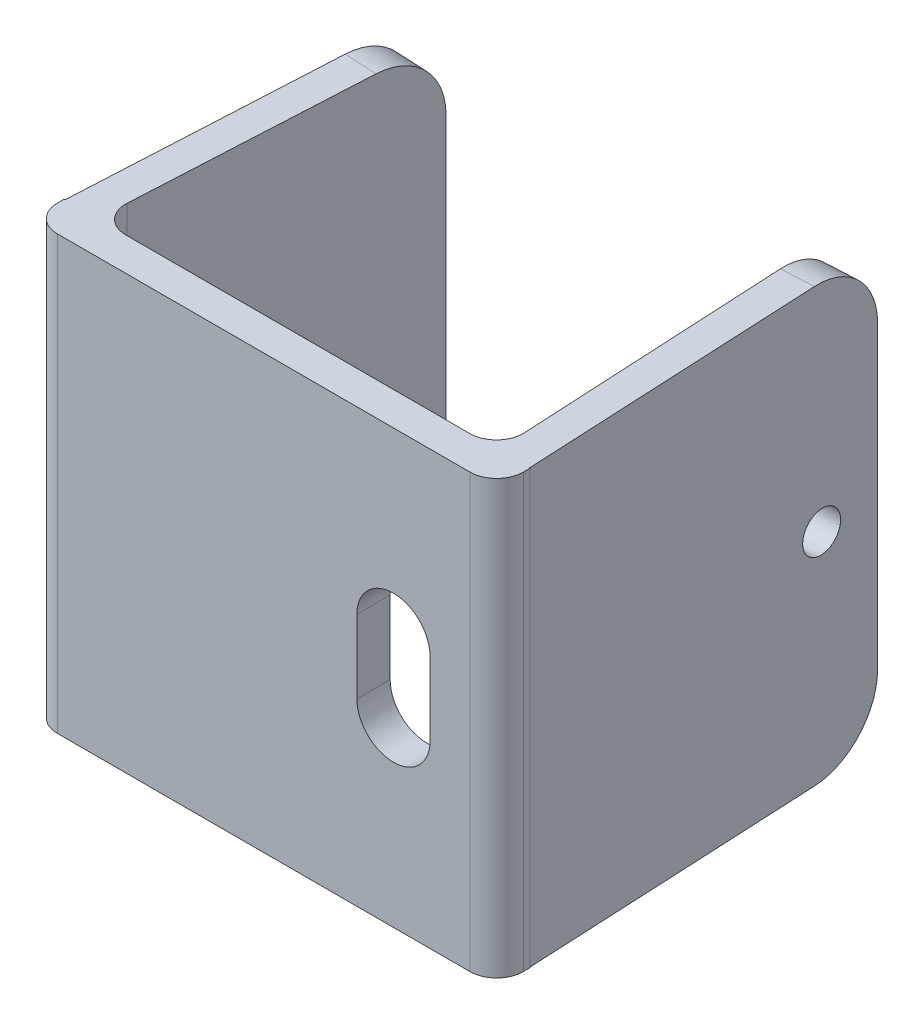
ISO-10303-21;
HEADER;
FILE_DESCRIPTION(('STEP AP214'),'2;1');
FILE_NAME('part.step','',(''),(''),'','','');
FILE_SCHEMA(('AUTOMOTIVE_DESIGN { 1 0 10303 214 1 1 1 1 }'));
ENDSEC;
DATA;
#1=APPLICATION_CONTEXT('core data for automotive mechanical design processes');
#2=APPLICATION_PROTOCOL_DEFINITION('international standard','automotive_design',2000,#1);
#3=PRODUCT_CONTEXT('',#1,'mechanical');
#4=PRODUCT('Part','Part','',(#3));
#5=PRODUCT_RELATED_PRODUCT_CATEGORY('part','',(#4));
#6=PRODUCT_DEFINITION_FORMATION('','',#4);
#7=PRODUCT_DEFINITION_CONTEXT('part definition',#1,'design');
#8=PRODUCT_DEFINITION('design','',#6,#7);
#9=PRODUCT_DEFINITION_SHAPE('','',#8);
#10=(LENGTH_UNIT() NAMED_UNIT(*) SI_UNIT(.MILLI.,.METRE.));
#11=(NAMED_UNIT(*) PLANE_ANGLE_UNIT() SI_UNIT($,.RADIAN.));
#12=(NAMED_UNIT(*) SI_UNIT($,.STERADIAN.) SOLID_ANGLE_UNIT());
#13=UNCERTAINTY_MEASURE_WITH_UNIT(LENGTH_MEASURE(1.E-05),#10,'distance_accuracy_value','');
#14=(GEOMETRIC_REPRESENTATION_CONTEXT(3) GLOBAL_UNCERTAINTY_ASSIGNED_CONTEXT((#13)) GLOBAL_UNIT_ASSIGNED_CONTEXT((#10,
#11,#12)) REPRESENTATION_CONTEXT('',''));
#15=CARTESIAN_POINT('',(0.,0.,0.));
#16=DIRECTION('',(0.,0.,1.));
#17=DIRECTION('',(1.,0.,0.));
#18=AXIS2_PLACEMENT_3D('',#15,#16,#17);
#19=CARTESIAN_POINT('',(0.,0.,0.));
#20=DIRECTION('',(0.,0.,1.));
#21=DIRECTION('',(1.,0.,0.));
#22=AXIS2_PLACEMENT_3D('',#19,#20,#21);
#23=PLANE('',#22);
#24=DIRECTION('',(1.,0.,0.));
#25=VECTOR('',#24,1.);
#26=CARTESIAN_POINT('',(17.5,-16.25,0.));
#27=LINE('',#26,#25);
#28=CARTESIAN_POINT('',(17.4598529224613,-16.25,0.));
#29=VERTEX_POINT('',#28);
#30=CARTESIAN_POINT('',(17.5,-16.25,0.));
#31=VERTEX_POINT('',#30);
#32=EDGE_CURVE('E271',#29,#31,#27,.T.);
#33=ORIENTED_EDGE('',*,*,#32,.F.);
#34=DIRECTION('',(0.,1.,0.));
#35=VECTOR('',#34,1.);
#36=CARTESIAN_POINT('',(17.4598529224613,0.,0.));
#37=LINE('',#36,#35);
#38=CARTESIAN_POINT('',(17.4598529224613,16.25,0.));
#39=VERTEX_POINT('',#38);
#40=EDGE_CURVE('E293',#29,#39,#37,.T.);
#41=ORIENTED_EDGE('',*,*,#40,.T.);
#42=DIRECTION('',(-1.,0.,0.));
#43=VECTOR('',#42,1.);
#44=CARTESIAN_POINT('',(17.5,16.25,0.));
#45=LINE('',#44,#43);
#46=CARTESIAN_POINT('',(17.5,16.25,0.));
#47=VERTEX_POINT('',#46);
#48=EDGE_CURVE('E265',#47,#39,#45,.T.);
#49=ORIENTED_EDGE('',*,*,#48,.F.);
#50=DIRECTION('',(0.,1.,0.));
#51=VECTOR('',#50,1.);
#52=CARTESIAN_POINT('',(17.5,-16.25,0.));
#53=LINE('',#52,#51);
#54=EDGE_CURVE('E275',#31,#47,#53,.T.);
#55=ORIENTED_EDGE('',*,*,#54,.F.);
#56=EDGE_LOOP('',(#33,#41,#49,#55));
#57=FACE_BOUND('',#56,.T.);
#58=ADVANCED_FACE('F35',(#57),#23,.F.);
#59=CARTESIAN_POINT('',(-17.4292836921049,16.25,0.));
#60=VERTEX_POINT('',#59);
#61=CARTESIAN_POINT('',(-17.5,16.25,0.));
#62=VERTEX_POINT('',#61);
#63=EDGE_CURVE('E279',#60,#62,#45,.T.);
#64=ORIENTED_EDGE('',*,*,#63,.F.);
#65=DIRECTION('',(0.,-1.,0.));
#66=VECTOR('',#65,1.);
#67=CARTESIAN_POINT('',(-17.4292836921049,0.,0.));
#68=LINE('',#67,#66);
#69=CARTESIAN_POINT('',(-17.4292836921049,-16.25,0.));
#70=VERTEX_POINT('',#69);
#71=EDGE_CURVE('E290',#60,#70,#68,.T.);
#72=ORIENTED_EDGE('',*,*,#71,.T.);
#73=CARTESIAN_POINT('',(-17.5,-16.25,0.));
#74=VERTEX_POINT('',#73);
#75=EDGE_CURVE('E272',#74,#70,#27,.T.);
#76=ORIENTED_EDGE('',*,*,#75,.F.);
#77=DIRECTION('',(0.,-1.,0.));
#78=VECTOR('',#77,1.);
#79=CARTESIAN_POINT('',(-17.5,-16.25,0.));
#80=LINE('',#79,#78);
#81=EDGE_CURVE('E260',#62,#74,#80,.T.);
#82=ORIENTED_EDGE('',*,*,#81,.F.);
#83=EDGE_LOOP('',(#64,#72,#76,#82));
#84=FACE_BOUND('',#83,.T.);
#85=ADVANCED_FACE('F394',(#84),#23,.F.);
#86=CARTESIAN_POINT('',(-17.5,-16.25,2.5));
#87=DIRECTION('',(1.,0.,0.));
#88=DIRECTION('',(0.,0.,-1.));
#89=AXIS2_PLACEMENT_3D('',#86,#87,#88);
#90=PLANE('',#89);
#91=DIRECTION('',(0.,0.,-1.));
#92=VECTOR('',#91,1.);
#93=CARTESIAN_POINT('',(-17.5,-16.25,2.5));
#94=LINE('',#93,#92);
#95=CARTESIAN_POINT('',(-17.5,-16.25,0.5));
#96=VERTEX_POINT('',#95);
#97=EDGE_CURVE('E288',#96,#74,#94,.T.);
#98=ORIENTED_EDGE('',*,*,#97,.F.);
#99=DIRECTION('',(0.,-1.,0.));
#100=VECTOR('',#99,1.);
#101=CARTESIAN_POINT('',(-17.5,16.25,0.5));
#102=LINE('',#101,#100);
#103=CARTESIAN_POINT('',(-17.5,16.25,0.5));
#104=VERTEX_POINT('',#103);
#105=EDGE_CURVE('E318',#96,#104,#102,.F.);
#106=ORIENTED_EDGE('',*,*,#105,.T.);
#107=DIRECTION('',(0.,0.,-1.));
#108=VECTOR('',#107,1.);
#109=CARTESIAN_POINT('',(-17.5,16.25,2.5));
#110=LINE('',#109,#108);
#111=EDGE_CURVE('E268',#104,#62,#110,.T.);
#112=ORIENTED_EDGE('',*,*,#111,.T.);
#113=ORIENTED_EDGE('',*,*,#81,.T.);
#114=EDGE_LOOP('',(#98,#106,#112,#113));
#115=FACE_BOUND('',#114,.T.);
#116=ADVANCED_FACE('F400',(#115),#90,.F.);
#117=CARTESIAN_POINT('',(17.5,-16.25,2.5));
#118=DIRECTION('',(0.,1.,0.));
#119=DIRECTION('',(0.,0.,1.));
#120=AXIS2_PLACEMENT_3D('',#117,#118,#119);
#121=PLANE('',#120);
#122=DIRECTION('',(-0.0516920789663743,0.,-0.998663070796219));
#123=VECTOR('',#122,1.);
#124=CARTESIAN_POINT('',(13.6759295593109,-16.25,-27.3719359468069));
#125=LINE('',#124,#123);
#126=CARTESIAN_POINT('',(14.9838621470204,-16.25,-2.10338415793275));
#127=VERTEX_POINT('',#126);
#128=CARTESIAN_POINT('',(13.9343900113653,-16.25,-22.3786194873182));
#129=VERTEX_POINT('',#128);
#130=EDGE_CURVE('E237',#127,#129,#125,.T.);
#131=ORIENTED_EDGE('',*,*,#130,.T.);
#132=DIRECTION('',(0.998628452320236,0.,-0.0523566062354244));
#133=VECTOR('',#132,1.);
#134=CARTESIAN_POINT('',(16.380353862213,-16.25,-22.5068577383988));
#135=LINE('',#134,#133);
#136=CARTESIAN_POINT('',(16.3621523674185,-16.25,-22.5059034610661));
#137=VERTEX_POINT('',#136);
#138=EDGE_CURVE('E337',#129,#137,#135,.T.);
#139=ORIENTED_EDGE('',*,*,#138,.T.);
#140=DIRECTION('',(0.0487159836036724,0.,0.998812671596394));
#141=VECTOR('',#140,1.);
#142=CARTESIAN_POINT('',(17.5,-16.25,0.823126350059698));
#143=LINE('',#142,#141);
#144=EDGE_CURVE('E235',#137,#29,#143,.T.);
#145=ORIENTED_EDGE('',*,*,#144,.T.);
#146=ORIENTED_EDGE('',*,*,#32,.T.);
#147=DIRECTION('',(0.,0.,-1.));
#148=VECTOR('',#147,1.);
#149=CARTESIAN_POINT('',(17.5,-16.25,2.5));
#150=LINE('',#149,#148);
#151=CARTESIAN_POINT('',(17.5,-16.25,0.5));
#152=VERTEX_POINT('',#151);
#153=EDGE_CURVE('E286',#152,#31,#150,.T.);
#154=ORIENTED_EDGE('',*,*,#153,.F.);
#155=CARTESIAN_POINT('',(15.5,-16.25,0.5));
#156=DIRECTION('',(0.,1.,0.));
#157=DIRECTION('',(0.,0.,1.));
#158=AXIS2_PLACEMENT_3D('',#155,#156,#157);
#159=CIRCLE('',#158,2.);
#160=CARTESIAN_POINT('',(15.5,-16.25,2.5));
#161=VERTEX_POINT('',#160);
#162=EDGE_CURVE('E314',#152,#161,#159,.F.);
#163=ORIENTED_EDGE('',*,*,#162,.T.);
#164=DIRECTION('',(1.,0.,0.));
#165=VECTOR('',#164,1.);
#166=CARTESIAN_POINT('',(17.5,-16.25,2.5));
#167=LINE('',#166,#165);
#168=CARTESIAN_POINT('',(-15.5,-16.25,2.5));
#169=VERTEX_POINT('',#168);
#170=EDGE_CURVE('E261',#169,#161,#167,.T.);
#171=ORIENTED_EDGE('',*,*,#170,.F.);
#172=CARTESIAN_POINT('',(-15.5,-16.25,0.5));
#173=DIRECTION('',(0.,1.,0.));
#174=DIRECTION('',(0.,0.,1.));
#175=AXIS2_PLACEMENT_3D('',#172,#173,#174);
#176=CIRCLE('',#175,2.);
#177=EDGE_CURVE('E316',#169,#96,#176,.F.);
#178=ORIENTED_EDGE('',*,*,#177,.T.);
#179=ORIENTED_EDGE('',*,*,#97,.T.);
#180=ORIENTED_EDGE('',*,*,#75,.T.);
#181=DIRECTION('',(0.0523566062354246,0.,-0.998628452320235));
#182=VECTOR('',#181,1.);
#183=CARTESIAN_POINT('',(-17.4321642402315,-16.25,0.0549423945573307));
#184=LINE('',#183,#182);
#185=CARTESIAN_POINT('',(-16.380353862213,-16.25,-20.0068577383988));
#186=VERTEX_POINT('',#185);
#187=EDGE_CURVE('E250',#70,#186,#184,.T.);
#188=ORIENTED_EDGE('',*,*,#187,.T.);
#189=DIRECTION('',(0.998628452320236,0.,0.0523566062354244));
#190=VECTOR('',#189,1.);
#191=CARTESIAN_POINT('',(-13.9377125904881,-16.25,-19.8787936852057));
#192=LINE('',#191,#190);
#193=CARTESIAN_POINT('',(-13.9377125904881,-16.25,-19.8787936852057));
#194=VERTEX_POINT('',#193);
#195=EDGE_CURVE('E334',#186,#194,#192,.T.);
#196=ORIENTED_EDGE('',*,*,#195,.T.);
#197=DIRECTION('',(-0.0523566062354247,0.,0.998628452320235));
#198=VECTOR('',#197,1.);
#199=CARTESIAN_POINT('',(-13.6759295593109,-16.25,-24.8719359468069));
#200=LINE('',#199,#198);
#201=CARTESIAN_POINT('',(-14.8695812252597,-16.25,-2.10471321247085));
#202=VERTEX_POINT('',#201);
#203=EDGE_CURVE('E234',#194,#202,#200,.T.);
#204=ORIENTED_EDGE('',*,*,#203,.T.);
#205=CARTESIAN_POINT('',(-12.8723243206192,-16.25,-2.));
#206=DIRECTION('',(0.,1.,0.));
#207=DIRECTION('',(0.,0.,1.));
#208=AXIS2_PLACEMENT_3D('',#205,#206,#207);
#209=CIRCLE('',#208,2.);
#210=CARTESIAN_POINT('',(-12.8723243206192,-16.25,0.));
#211=VERTEX_POINT('',#210);
#212=EDGE_CURVE('E332',#202,#211,#209,.T.);
#213=ORIENTED_EDGE('',*,*,#212,.T.);
#214=CARTESIAN_POINT('',(12.986536005428,-16.25,0.));
#215=VERTEX_POINT('',#214);
#216=EDGE_CURVE('E276',#211,#215,#27,.T.);
#217=ORIENTED_EDGE('',*,*,#216,.T.);
#218=CARTESIAN_POINT('',(12.986536005428,-16.25,-2.));
#219=DIRECTION('',(0.,1.,0.));
#220=DIRECTION('',(0.,0.,1.));
#221=AXIS2_PLACEMENT_3D('',#218,#219,#220);
#222=CIRCLE('',#221,2.);
#223=EDGE_CURVE('E326',#215,#127,#222,.T.);
#224=ORIENTED_EDGE('',*,*,#223,.T.);
#225=EDGE_LOOP('',(#131,#139,#145,#146,#154,#163,#171,#178,#179,#180,#188,#196,#204,#213,#217,#224));
#226=FACE_BOUND('',#225,.T.);
#227=ADVANCED_FACE('F460',(#226),#121,.F.);
#228=CARTESIAN_POINT('',(17.5,-16.25,2.5));
#229=DIRECTION('',(-1.,0.,0.));
#230=DIRECTION('',(0.,0.,1.));
#231=AXIS2_PLACEMENT_3D('',#228,#229,#230);
#232=PLANE('',#231);
#233=DIRECTION('',(0.,0.,-1.));
#234=VECTOR('',#233,1.);
#235=CARTESIAN_POINT('',(17.5,16.25,2.5));
#236=LINE('',#235,#234);
#237=CARTESIAN_POINT('',(17.5,16.25,0.5));
#238=VERTEX_POINT('',#237);
#239=EDGE_CURVE('E284',#238,#47,#236,.T.);
#240=ORIENTED_EDGE('',*,*,#239,.F.);
#241=DIRECTION('',(0.,1.,0.));
#242=VECTOR('',#241,1.);
#243=CARTESIAN_POINT('',(17.5,-16.25,0.5));
#244=LINE('',#243,#242);
#245=EDGE_CURVE('E324',#238,#152,#244,.F.);
#246=ORIENTED_EDGE('',*,*,#245,.T.);
#247=ORIENTED_EDGE('',*,*,#153,.T.);
#248=ORIENTED_EDGE('',*,*,#54,.T.);
#249=EDGE_LOOP('',(#240,#246,#247,#248));
#250=FACE_BOUND('',#249,.T.);
#251=ADVANCED_FACE('F418',(#250),#232,.F.);
#252=CARTESIAN_POINT('',(17.5,16.25,2.5));
#253=DIRECTION('',(0.,-1.,0.));
#254=DIRECTION('',(1.,0.,0.));
#255=AXIS2_PLACEMENT_3D('',#252,#253,#254);
#256=PLANE('',#255);
#257=DIRECTION('',(-0.0487159836036724,0.,-0.998812671596395));
#258=VECTOR('',#257,1.);
#259=CARTESIAN_POINT('',(17.5,16.25,0.823126350059698));
#260=LINE('',#259,#258);
#261=CARTESIAN_POINT('',(16.3621523674185,16.25,-22.5059034610661));
#262=VERTEX_POINT('',#261);
#263=EDGE_CURVE('E230',#39,#262,#260,.T.);
#264=ORIENTED_EDGE('',*,*,#263,.T.);
#265=DIRECTION('',(-0.998628452320236,0.,0.0523566062354244));
#266=VECTOR('',#265,1.);
#267=CARTESIAN_POINT('',(13.9377125904881,16.25,-22.3787936852057));
#268=LINE('',#267,#266);
#269=CARTESIAN_POINT('',(13.9343900113653,16.25,-22.3786194873182));
#270=VERTEX_POINT('',#269);
#271=EDGE_CURVE('E355',#262,#270,#268,.T.);
#272=ORIENTED_EDGE('',*,*,#271,.T.);
#273=DIRECTION('',(0.0516920789663743,0.,0.998663070796219));
#274=VECTOR('',#273,1.);
#275=CARTESIAN_POINT('',(13.6759295593109,16.25,-27.3719359468069));
#276=LINE('',#275,#274);
#277=CARTESIAN_POINT('',(14.9838621470204,16.25,-2.10338415793275));
#278=VERTEX_POINT('',#277);
#279=EDGE_CURVE('E228',#270,#278,#276,.T.);
#280=ORIENTED_EDGE('',*,*,#279,.T.);
#281=CARTESIAN_POINT('',(12.986536005428,16.25,-2.));
#282=DIRECTION('',(0.,-1.,0.));
#283=DIRECTION('',(1.,0.,0.));
#284=AXIS2_PLACEMENT_3D('',#281,#282,#283);
#285=CIRCLE('',#284,2.);
#286=CARTESIAN_POINT('',(12.986536005428,16.25,0.));
#287=VERTEX_POINT('',#286);
#288=EDGE_CURVE('E328',#278,#287,#285,.T.);
#289=ORIENTED_EDGE('',*,*,#288,.T.);
#290=CARTESIAN_POINT('',(-12.8723243206192,16.25,0.));
#291=VERTEX_POINT('',#290);
#292=EDGE_CURVE('E282',#287,#291,#45,.T.);
#293=ORIENTED_EDGE('',*,*,#292,.T.);
#294=CARTESIAN_POINT('',(-12.8723243206192,16.25,-2.));
#295=DIRECTION('',(0.,-1.,0.));
#296=DIRECTION('',(1.,0.,0.));
#297=AXIS2_PLACEMENT_3D('',#294,#295,#296);
#298=CIRCLE('',#297,2.);
#299=CARTESIAN_POINT('',(-14.8695812252597,16.25,-2.10471321247085));
#300=VERTEX_POINT('',#299);
#301=EDGE_CURVE('E330',#291,#300,#298,.T.);
#302=ORIENTED_EDGE('',*,*,#301,.T.);
#303=DIRECTION('',(0.0523566062354247,0.,-0.998628452320235));
#304=VECTOR('',#303,1.);
#305=CARTESIAN_POINT('',(-13.6759295593109,16.25,-24.8719359468069));
#306=LINE('',#305,#304);
#307=CARTESIAN_POINT('',(-13.9377125904881,16.25,-19.8787936852057));
#308=VERTEX_POINT('',#307);
#309=EDGE_CURVE('E247',#300,#308,#306,.T.);
#310=ORIENTED_EDGE('',*,*,#309,.T.);
#311=DIRECTION('',(-0.998628452320236,0.,-0.0523566062354244));
#312=VECTOR('',#311,1.);
#313=CARTESIAN_POINT('',(-16.380353862213,16.25,-20.0068577383988));
#314=LINE('',#313,#312);
#315=CARTESIAN_POINT('',(-16.380353862213,16.25,-20.0068577383988));
#316=VERTEX_POINT('',#315);
#317=EDGE_CURVE('E352',#308,#316,#314,.T.);
#318=ORIENTED_EDGE('',*,*,#317,.T.);
#319=DIRECTION('',(-0.0523566062354246,0.,0.998628452320236));
#320=VECTOR('',#319,1.);
#321=CARTESIAN_POINT('',(-17.4321642402315,16.25,0.0549423945573305));
#322=LINE('',#321,#320);
#323=EDGE_CURVE('E245',#316,#60,#322,.T.);
#324=ORIENTED_EDGE('',*,*,#323,.T.);
#325=ORIENTED_EDGE('',*,*,#63,.T.);
#326=ORIENTED_EDGE('',*,*,#111,.F.);
#327=CARTESIAN_POINT('',(-15.5,16.25,0.5));
#328=DIRECTION('',(0.,-1.,0.));
#329=DIRECTION('',(1.,0.,0.));
#330=AXIS2_PLACEMENT_3D('',#327,#328,#329);
#331=CIRCLE('',#330,2.);
#332=CARTESIAN_POINT('',(-15.5,16.25,2.5));
#333=VERTEX_POINT('',#332);
#334=EDGE_CURVE('E322',#104,#333,#331,.F.);
#335=ORIENTED_EDGE('',*,*,#334,.T.);
#336=DIRECTION('',(-1.,0.,0.));
#337=VECTOR('',#336,1.);
#338=CARTESIAN_POINT('',(17.5,16.25,2.5));
#339=LINE('',#338,#337);
#340=CARTESIAN_POINT('',(15.5,16.25,2.5));
#341=VERTEX_POINT('',#340);
#342=EDGE_CURVE('E264',#341,#333,#339,.T.);
#343=ORIENTED_EDGE('',*,*,#342,.F.);
#344=CARTESIAN_POINT('',(15.5,16.25,0.5));
#345=DIRECTION('',(0.,-1.,0.));
#346=DIRECTION('',(1.,0.,0.));
#347=AXIS2_PLACEMENT_3D('',#344,#345,#346);
#348=CIRCLE('',#347,2.);
#349=EDGE_CURVE('E320',#341,#238,#348,.F.);
#350=ORIENTED_EDGE('',*,*,#349,.T.);
#351=ORIENTED_EDGE('',*,*,#239,.T.);
#352=ORIENTED_EDGE('',*,*,#48,.T.);
#353=EDGE_LOOP('',(#264,#272,#280,#289,#293,#302,#310,#318,#324,#325,#326,#335,#343,#350,#351,#352));
#354=FACE_BOUND('',#353,.T.);
#355=ADVANCED_FACE('F414',(#354),#256,.F.);
#356=CARTESIAN_POINT('',(0.,0.,2.5));
#357=DIRECTION('',(0.,0.,1.));
#358=DIRECTION('',(1.,0.,0.));
#359=AXIS2_PLACEMENT_3D('',#356,#357,#358);
#360=PLANE('',#359);
#361=CARTESIAN_POINT('',(9.75000000000001,2.75,2.5));
#362=DIRECTION('',(0.,0.,1.));
#363=DIRECTION('',(1.,0.,0.));
#364=AXIS2_PLACEMENT_3D('',#361,#362,#363);
#365=CIRCLE('',#364,2.75);
#366=CARTESIAN_POINT('',(12.5,2.75,2.5));
#367=VERTEX_POINT('',#366);
#368=CARTESIAN_POINT('',(7.00000000000001,2.75,2.5));
#369=VERTEX_POINT('',#368);
#370=EDGE_CURVE('E50',#367,#369,#365,.T.);
#371=ORIENTED_EDGE('',*,*,#370,.F.);
#372=DIRECTION('',(0.,1.,0.));
#373=VECTOR('',#372,1.);
#374=CARTESIAN_POINT('',(12.5,2.75,2.5));
#375=LINE('',#374,#373);
#376=CARTESIAN_POINT('',(12.5,-2.75,2.5));
#377=VERTEX_POINT('',#376);
#378=EDGE_CURVE('E215',#377,#367,#375,.T.);
#379=ORIENTED_EDGE('',*,*,#378,.F.);
#380=CARTESIAN_POINT('',(9.75000000000001,-2.75,2.5));
#381=DIRECTION('',(0.,0.,1.));
#382=DIRECTION('',(1.,0.,0.));
#383=AXIS2_PLACEMENT_3D('',#380,#381,#382);
#384=CIRCLE('',#383,2.75);
#385=CARTESIAN_POINT('',(7.00000000000001,-2.75,2.5));
#386=VERTEX_POINT('',#385);
#387=EDGE_CURVE('E199',#386,#377,#384,.T.);
#388=ORIENTED_EDGE('',*,*,#387,.F.);
#389=DIRECTION('',(0.,-1.,0.));
#390=VECTOR('',#389,1.);
#391=CARTESIAN_POINT('',(7.00000000000001,2.75,2.5));
#392=LINE('',#391,#390);
#393=EDGE_CURVE('E208',#369,#386,#392,.T.);
#394=ORIENTED_EDGE('',*,*,#393,.F.);
#395=EDGE_LOOP('',(#371,#379,#388,#394));
#396=FACE_BOUND('',#395,.T.);
#397=ORIENTED_EDGE('',*,*,#342,.T.);
#398=DIRECTION('',(0.,-1.,0.));
#399=VECTOR('',#398,1.);
#400=CARTESIAN_POINT('',(-15.5,-16.25,2.5));
#401=LINE('',#400,#399);
#402=EDGE_CURVE('E311',#333,#169,#401,.T.);
#403=ORIENTED_EDGE('',*,*,#402,.T.);
#404=ORIENTED_EDGE('',*,*,#170,.T.);
#405=DIRECTION('',(0.,1.,0.));
#406=VECTOR('',#405,1.);
#407=CARTESIAN_POINT('',(15.5,16.25,2.5));
#408=LINE('',#407,#406);
#409=EDGE_CURVE('E308',#161,#341,#408,.T.);
#410=ORIENTED_EDGE('',*,*,#409,.T.);
#411=EDGE_LOOP('',(#397,#403,#404,#410));
#412=FACE_BOUND('',#411,.T.);
#413=ADVANCED_FACE('F212',(#396,#412),#360,.T.);
#414=DIRECTION('',(0.,1.,0.));
#415=VECTOR('',#414,1.);
#416=CARTESIAN_POINT('',(12.5,0.,0.));
#417=LINE('',#416,#415);
#418=CARTESIAN_POINT('',(12.5,-2.75,0.));
#419=VERTEX_POINT('',#418);
#420=CARTESIAN_POINT('',(12.5,2.75,0.));
#421=VERTEX_POINT('',#420);
#422=EDGE_CURVE('E43',#419,#421,#417,.T.);
#423=ORIENTED_EDGE('',*,*,#422,.T.);
#424=CARTESIAN_POINT('',(9.75000000000001,2.75,0.));
#425=DIRECTION('',(0.,0.,1.));
#426=DIRECTION('',(1.,0.,0.));
#427=AXIS2_PLACEMENT_3D('',#424,#425,#426);
#428=CIRCLE('',#427,2.75);
#429=CARTESIAN_POINT('',(7.00000000000001,2.75,0.));
#430=VERTEX_POINT('',#429);
#431=EDGE_CURVE('E11',#421,#430,#428,.T.);
#432=ORIENTED_EDGE('',*,*,#431,.T.);
#433=DIRECTION('',(0.,-1.,0.));
#434=VECTOR('',#433,1.);
#435=CARTESIAN_POINT('',(7.00000000000001,0.,0.));
#436=LINE('',#435,#434);
#437=CARTESIAN_POINT('',(7.00000000000001,-2.75,0.));
#438=VERTEX_POINT('',#437);
#439=EDGE_CURVE('E370',#430,#438,#436,.T.);
#440=ORIENTED_EDGE('',*,*,#439,.T.);
#441=CARTESIAN_POINT('',(9.75000000000001,-2.75,0.));
#442=DIRECTION('',(0.,0.,1.));
#443=DIRECTION('',(1.,0.,0.));
#444=AXIS2_PLACEMENT_3D('',#441,#442,#443);
#445=CIRCLE('',#444,2.75);
#446=EDGE_CURVE('E202',#438,#419,#445,.T.);
#447=ORIENTED_EDGE('',*,*,#446,.T.);
#448=EDGE_LOOP('',(#423,#432,#440,#447));
#449=FACE_BOUND('',#448,.T.);
#450=ORIENTED_EDGE('',*,*,#292,.F.);
#451=DIRECTION('',(0.,-1.,0.));
#452=VECTOR('',#451,1.);
#453=CARTESIAN_POINT('',(12.986536005428,0.,0.));
#454=LINE('',#453,#452);
#455=EDGE_CURVE('E299',#287,#215,#454,.T.);
#456=ORIENTED_EDGE('',*,*,#455,.T.);
#457=ORIENTED_EDGE('',*,*,#216,.F.);
#458=DIRECTION('',(0.,1.,0.));
#459=VECTOR('',#458,1.);
#460=CARTESIAN_POINT('',(-12.8723243206192,0.,0.));
#461=LINE('',#460,#459);
#462=EDGE_CURVE('E296',#211,#291,#461,.T.);
#463=ORIENTED_EDGE('',*,*,#462,.T.);
#464=EDGE_LOOP('',(#450,#456,#457,#463));
#465=FACE_BOUND('',#464,.T.);
#466=ADVANCED_FACE('F376',(#449,#465),#23,.F.);
#467=CARTESIAN_POINT('',(-17.4321642402315,44.8301154822159,0.0549423945573307));
#468=DIRECTION('',(-0.998628452320235,0.,-0.0523566062354246));
#469=DIRECTION('',(-0.0523566062354246,0.,0.998628452320236));
#470=AXIS2_PLACEMENT_3D('',#467,#468,#469);
#471=PLANE('',#470);
#472=DIRECTION('',(0.,-1.,0.));
#473=VECTOR('',#472,1.);
#474=CARTESIAN_POINT('',(-16.1185708310359,44.8301154822159,-25.));
#475=LINE('',#474,#473);
#476=CARTESIAN_POINT('',(-16.1185708310359,11.25,-25.));
#477=VERTEX_POINT('',#476);
#478=CARTESIAN_POINT('',(-16.1185708310359,-11.25,-25.));
#479=VERTEX_POINT('',#478);
#480=EDGE_CURVE('E248',#477,#479,#475,.T.);
#481=ORIENTED_EDGE('',*,*,#480,.T.);
#482=CARTESIAN_POINT('',(-16.380353862213,-11.25,-20.0068577383988));
#483=DIRECTION('',(-0.998628452320235,0.,-0.0523566062354246));
#484=DIRECTION('',(-0.0523566062354246,0.,0.998628452320236));
#485=AXIS2_PLACEMENT_3D('',#482,#483,#484);
#486=CIRCLE('',#485,5.);
#487=EDGE_CURVE('E368',#479,#186,#486,.T.);
#488=ORIENTED_EDGE('',*,*,#487,.T.);
#489=ORIENTED_EDGE('',*,*,#187,.F.);
#490=ORIENTED_EDGE('',*,*,#71,.F.);
#491=ORIENTED_EDGE('',*,*,#323,.F.);
#492=CARTESIAN_POINT('',(-16.380353862213,11.25,-20.0068577383988));
#493=DIRECTION('',(-0.998628452320235,0.,-0.0523566062354246));
#494=DIRECTION('',(-0.0523566062354246,0.,0.998628452320236));
#495=AXIS2_PLACEMENT_3D('',#492,#493,#494);
#496=CIRCLE('',#495,5.);
#497=EDGE_CURVE('E366',#316,#477,#496,.T.);
#498=ORIENTED_EDGE('',*,*,#497,.T.);
#499=EDGE_LOOP('',(#481,#488,#489,#490,#491,#498));
#500=FACE_BOUND('',#499,.T.);
#501=ADVANCED_FACE('F406',(#500),#471,.T.);
#502=CARTESIAN_POINT('',(-13.6759295593109,44.8301154822159,-24.8719359468069));
#503=DIRECTION('',(0.998628452320235,0.,0.0523566062354247));
#504=DIRECTION('',(0.0523566062354247,0.,-0.998628452320235));
#505=AXIS2_PLACEMENT_3D('',#502,#503,#504);
#506=PLANE('',#505);
#507=ORIENTED_EDGE('',*,*,#203,.F.);
#508=CARTESIAN_POINT('',(-13.9377125904881,-11.25,-19.8787936852057));
#509=DIRECTION('',(0.998628452320235,0.,0.0523566062354247));
#510=DIRECTION('',(0.0523566062354247,0.,-0.998628452320235));
#511=AXIS2_PLACEMENT_3D('',#508,#509,#510);
#512=CIRCLE('',#511,5.);
#513=CARTESIAN_POINT('',(-13.6759295593109,-11.25,-24.8719359468069));
#514=VERTEX_POINT('',#513);
#515=EDGE_CURVE('E360',#194,#514,#512,.T.);
#516=ORIENTED_EDGE('',*,*,#515,.T.);
#517=DIRECTION('',(0.,-1.,0.));
#518=VECTOR('',#517,1.);
#519=CARTESIAN_POINT('',(-13.6759295593109,44.8301154822159,-24.8719359468069));
#520=LINE('',#519,#518);
#521=CARTESIAN_POINT('',(-13.6759295593109,11.25,-24.8719359468069));
#522=VERTEX_POINT('',#521);
#523=EDGE_CURVE('E253',#522,#514,#520,.T.);
#524=ORIENTED_EDGE('',*,*,#523,.F.);
#525=CARTESIAN_POINT('',(-13.9377125904881,11.25,-19.8787936852057));
#526=DIRECTION('',(0.998628452320235,0.,0.0523566062354247));
#527=DIRECTION('',(0.0523566062354247,0.,-0.998628452320235));
#528=AXIS2_PLACEMENT_3D('',#525,#526,#527);
#529=CIRCLE('',#528,5.);
#530=EDGE_CURVE('E358',#522,#308,#529,.T.);
#531=ORIENTED_EDGE('',*,*,#530,.T.);
#532=ORIENTED_EDGE('',*,*,#309,.F.);
#533=DIRECTION('',(0.,1.,0.));
#534=VECTOR('',#533,1.);
#535=CARTESIAN_POINT('',(-14.8695812252597,44.8301154822159,-2.10471321247085));
#536=LINE('',#535,#534);
#537=EDGE_CURVE('E305',#300,#202,#536,.F.);
#538=ORIENTED_EDGE('',*,*,#537,.T.);
#539=EDGE_LOOP('',(#507,#516,#524,#531,#532,#538));
#540=FACE_BOUND('',#539,.T.);
#541=ADVANCED_FACE('F411',(#540),#506,.T.);
#542=CARTESIAN_POINT('',(-16.1185708310359,44.8301154822159,-25.));
#543=DIRECTION('',(0.0523566062354244,0.,-0.998628452320235));
#544=DIRECTION('',(-0.998628452320236,0.,-0.0523566062354244));
#545=AXIS2_PLACEMENT_3D('',#542,#543,#544);
#546=PLANE('',#545);
#547=ORIENTED_EDGE('',*,*,#523,.T.);
#548=DIRECTION('',(0.998628452320236,0.,0.0523566062354244));
#549=VECTOR('',#548,1.);
#550=CARTESIAN_POINT('',(-16.1185708310359,-11.25,-25.));
#551=LINE('',#550,#549);
#552=EDGE_CURVE('E364',#514,#479,#551,.F.);
#553=ORIENTED_EDGE('',*,*,#552,.T.);
#554=ORIENTED_EDGE('',*,*,#480,.F.);
#555=DIRECTION('',(-0.998628452320236,0.,-0.0523566062354244));
#556=VECTOR('',#555,1.);
#557=CARTESIAN_POINT('',(-13.675929559311,11.25,-24.8719359468069));
#558=LINE('',#557,#556);
#559=EDGE_CURVE('E362',#477,#522,#558,.F.);
#560=ORIENTED_EDGE('',*,*,#559,.T.);
#561=EDGE_LOOP('',(#547,#553,#554,#560));
#562=FACE_BOUND('',#561,.T.);
#563=ADVANCED_FACE('F421',(#562),#546,.T.);
#564=CARTESIAN_POINT('',(17.5,44.8301154822159,0.823126350059698));
#565=DIRECTION('',(0.998812671596394,0.,-0.0487159836036724));
#566=DIRECTION('',(-0.0487159836036724,0.,-0.998812671596395));
#567=AXIS2_PLACEMENT_3D('',#564,#565,#566);
#568=PLANE('',#567);
#569=CARTESIAN_POINT('',(16.3341625148755,0.,-23.079773007117));
#570=DIRECTION('',(0.998812671596395,0.,-0.0487159836036724));
#571=DIRECTION('',(-0.0487159836036724,0.,-0.998812671596395));
#572=AXIS2_PLACEMENT_3D('',#569,#570,#571);
#573=CIRCLE('',#572,1.5);
#574=CARTESIAN_POINT('',(16.26108853947,0.,-24.5779920145116));
#575=VERTEX_POINT('',#574);
#576=EDGE_CURVE('E222',#575,#575,#573,.T.);
#577=ORIENTED_EDGE('',*,*,#576,.F.);
#578=EDGE_LOOP('',(#577));
#579=FACE_BOUND('',#578,.T.);
#580=ORIENTED_EDGE('',*,*,#144,.F.);
#581=CARTESIAN_POINT('',(16.3621523674185,-11.25,-22.5059034610661));
#582=DIRECTION('',(0.998812671596394,0.,-0.0487159836036724));
#583=DIRECTION('',(0.0487159836036724,0.,0.998812671596395));
#584=AXIS2_PLACEMENT_3D('',#581,#582,#583);
#585=ELLIPSE('',#584,5.00003322039544,5.);
#586=CARTESIAN_POINT('',(16.1185708310359,-11.25,-27.5));
#587=VERTEX_POINT('',#586);
#588=EDGE_CURVE('E342',#137,#587,#585,.T.);
#589=ORIENTED_EDGE('',*,*,#588,.T.);
#590=DIRECTION('',(0.,-1.,0.));
#591=VECTOR('',#590,1.);
#592=CARTESIAN_POINT('',(16.1185708310359,44.8301154822159,-27.5));
#593=LINE('',#592,#591);
#594=CARTESIAN_POINT('',(16.1185708310359,11.25,-27.5));
#595=VERTEX_POINT('',#594);
#596=EDGE_CURVE('E231',#595,#587,#593,.T.);
#597=ORIENTED_EDGE('',*,*,#596,.F.);
#598=CARTESIAN_POINT('',(16.3621523674185,11.25,-22.5059034610661));
#599=DIRECTION('',(0.998812671596394,0.,-0.0487159836036724));
#600=DIRECTION('',(-0.0487159836036724,0.,-0.998812671596395));
#601=AXIS2_PLACEMENT_3D('',#598,#599,#600);
#602=ELLIPSE('',#601,5.00003322039544,5.);
#603=EDGE_CURVE('E340',#595,#262,#602,.T.);
#604=ORIENTED_EDGE('',*,*,#603,.T.);
#605=ORIENTED_EDGE('',*,*,#263,.F.);
#606=ORIENTED_EDGE('',*,*,#40,.F.);
#607=EDGE_LOOP('',(#580,#589,#597,#604,#605,#606));
#608=FACE_BOUND('',#607,.T.);
#609=ADVANCED_FACE('F424',(#579,#608),#568,.T.);
#610=CARTESIAN_POINT('',(13.6759295593109,44.8301154822159,-27.3719359468069));
#611=DIRECTION('',(-0.998663070796219,0.,0.0516920789663743));
#612=DIRECTION('',(0.0516920789663743,0.,0.998663070796219));
#613=AXIS2_PLACEMENT_3D('',#610,#611,#612);
#614=PLANE('',#613);
#615=CARTESIAN_POINT('',(13.90423200823,0.,-22.9612558335907));
#616=DIRECTION('',(-0.998663070796219,0.,0.0516920789663743));
#617=DIRECTION('',(0.0516920789663743,0.,0.998663070796219));
#618=AXIS2_PLACEMENT_3D('',#615,#616,#617);
#619=ELLIPSE('',#618,1.50000665967257,1.5);
#620=CARTESIAN_POINT('',(13.9817704709319,0.,-21.4632545766273));
#621=VERTEX_POINT('',#620);
#622=EDGE_CURVE('E227',#621,#621,#619,.T.);
#623=ORIENTED_EDGE('',*,*,#622,.F.);
#624=EDGE_LOOP('',(#623));
#625=FACE_BOUND('',#624,.T.);
#626=DIRECTION('',(0.,-1.,0.));
#627=VECTOR('',#626,1.);
#628=CARTESIAN_POINT('',(13.6759295593109,44.8301154822159,-27.3719359468069));
#629=LINE('',#628,#627);
#630=CARTESIAN_POINT('',(13.6759295593109,11.25,-27.3719359468069));
#631=VERTEX_POINT('',#630);
#632=CARTESIAN_POINT('',(13.6759295593109,-11.25,-27.3719359468069));
#633=VERTEX_POINT('',#632);
#634=EDGE_CURVE('E240',#631,#633,#629,.T.);
#635=ORIENTED_EDGE('',*,*,#634,.T.);
#636=CARTESIAN_POINT('',(13.9343900113653,-11.25,-22.3786194873182));
#637=DIRECTION('',(-0.998663070796219,0.,0.0516920789663743));
#638=DIRECTION('',(0.0516920789663743,1.48768096325087E-13,0.998663070796219));
#639=AXIS2_PLACEMENT_3D('',#636,#637,#638);
#640=ELLIPSE('',#639,5.00000110698757,5.);
#641=EDGE_CURVE('E350',#633,#129,#640,.T.);
#642=ORIENTED_EDGE('',*,*,#641,.T.);
#643=ORIENTED_EDGE('',*,*,#130,.F.);
#644=DIRECTION('',(0.,-1.,0.));
#645=VECTOR('',#644,1.);
#646=CARTESIAN_POINT('',(14.9838621470204,44.8301154822159,-2.10338415793275));
#647=LINE('',#646,#645);
#648=EDGE_CURVE('E302',#127,#278,#647,.F.);
#649=ORIENTED_EDGE('',*,*,#648,.T.);
#650=ORIENTED_EDGE('',*,*,#279,.F.);
#651=CARTESIAN_POINT('',(13.9343900113653,11.25,-22.3786194873182));
#652=DIRECTION('',(-0.998663070796219,0.,0.0516920789663743));
#653=DIRECTION('',(-0.0516920789663743,1.48757848157898E-13,-0.998663070796219));
#654=AXIS2_PLACEMENT_3D('',#651,#652,#653);
#655=ELLIPSE('',#654,5.00000110698757,5.);
#656=EDGE_CURVE('E348',#270,#631,#655,.T.);
#657=ORIENTED_EDGE('',*,*,#656,.T.);
#658=EDGE_LOOP('',(#635,#642,#643,#649,#650,#657));
#659=FACE_BOUND('',#658,.T.);
#660=ADVANCED_FACE('F431',(#625,#659),#614,.T.);
#661=CARTESIAN_POINT('',(16.1185708310359,44.8301154822159,-27.5));
#662=DIRECTION('',(-0.0523566062354244,0.,-0.998628452320235));
#663=DIRECTION('',(-0.998628452320236,0.,0.0523566062354244));
#664=AXIS2_PLACEMENT_3D('',#661,#662,#663);
#665=PLANE('',#664);
#666=ORIENTED_EDGE('',*,*,#596,.T.);
#667=DIRECTION('',(0.998628452320236,0.,-0.0523566062354244));
#668=VECTOR('',#667,1.);
#669=CARTESIAN_POINT('',(13.6759295593109,-11.25,-27.3719359468069));
#670=LINE('',#669,#668);
#671=EDGE_CURVE('E346',#587,#633,#670,.F.);
#672=ORIENTED_EDGE('',*,*,#671,.T.);
#673=ORIENTED_EDGE('',*,*,#634,.F.);
#674=DIRECTION('',(-0.998628452320236,0.,0.0523566062354244));
#675=VECTOR('',#674,1.);
#676=CARTESIAN_POINT('',(16.1185708310359,11.25,-27.5));
#677=LINE('',#676,#675);
#678=EDGE_CURVE('E344',#631,#595,#677,.F.);
#679=ORIENTED_EDGE('',*,*,#678,.T.);
#680=EDGE_LOOP('',(#666,#672,#673,#679));
#681=FACE_BOUND('',#680,.T.);
#682=ADVANCED_FACE('F435',(#681),#665,.T.);
#683=CARTESIAN_POINT('',(12.986536005428,0.,-2.));
#684=DIRECTION('',(0.,-1.,0.));
#685=DIRECTION('',(1.,0.,0.));
#686=AXIS2_PLACEMENT_3D('',#683,#684,#685);
#687=CYLINDRICAL_SURFACE('',#686,2.);
#688=ORIENTED_EDGE('',*,*,#288,.F.);
#689=ORIENTED_EDGE('',*,*,#648,.F.);
#690=ORIENTED_EDGE('',*,*,#223,.F.);
#691=ORIENTED_EDGE('',*,*,#455,.F.);
#692=EDGE_LOOP('',(#688,#689,#690,#691));
#693=FACE_BOUND('',#692,.T.);
#694=ADVANCED_FACE('F438',(#693),#687,.F.);
#695=CARTESIAN_POINT('',(-12.8723243206192,0.,-2.));
#696=DIRECTION('',(0.,1.,0.));
#697=DIRECTION('',(-1.,0.,0.));
#698=AXIS2_PLACEMENT_3D('',#695,#696,#697);
#699=CYLINDRICAL_SURFACE('',#698,2.);
#700=ORIENTED_EDGE('',*,*,#212,.F.);
#701=ORIENTED_EDGE('',*,*,#537,.F.);
#702=ORIENTED_EDGE('',*,*,#301,.F.);
#703=ORIENTED_EDGE('',*,*,#462,.F.);
#704=EDGE_LOOP('',(#700,#701,#702,#703));
#705=FACE_BOUND('',#704,.T.);
#706=ADVANCED_FACE('F443',(#705),#699,.F.);
#707=CARTESIAN_POINT('',(-15.5,0.,0.5));
#708=DIRECTION('',(0.,1.,0.));
#709=DIRECTION('',(0.,0.,1.));
#710=AXIS2_PLACEMENT_3D('',#707,#708,#709);
#711=CYLINDRICAL_SURFACE('',#710,2.);
#712=ORIENTED_EDGE('',*,*,#334,.F.);
#713=ORIENTED_EDGE('',*,*,#105,.F.);
#714=ORIENTED_EDGE('',*,*,#177,.F.);
#715=ORIENTED_EDGE('',*,*,#402,.F.);
#716=EDGE_LOOP('',(#712,#713,#714,#715));
#717=FACE_BOUND('',#716,.T.);
#718=ADVANCED_FACE('F481',(#717),#711,.T.);
#719=CARTESIAN_POINT('',(15.5,0.,0.5));
#720=DIRECTION('',(0.,-1.,0.));
#721=DIRECTION('',(0.,0.,-1.));
#722=AXIS2_PLACEMENT_3D('',#719,#720,#721);
#723=CYLINDRICAL_SURFACE('',#722,2.);
#724=ORIENTED_EDGE('',*,*,#162,.F.);
#725=ORIENTED_EDGE('',*,*,#245,.F.);
#726=ORIENTED_EDGE('',*,*,#349,.F.);
#727=ORIENTED_EDGE('',*,*,#409,.F.);
#728=EDGE_LOOP('',(#724,#725,#726,#727));
#729=FACE_BOUND('',#728,.T.);
#730=ADVANCED_FACE('F488',(#729),#723,.T.);
#731=CARTESIAN_POINT('',(16.1894523382914,-11.25,-22.4968490550948));
#732=DIRECTION('',(-0.998628452320236,0.,0.0523566062354244));
#733=DIRECTION('',(0.0523566062354244,0.,0.998628452320236));
#734=AXIS2_PLACEMENT_3D('',#731,#732,#733);
#735=CYLINDRICAL_SURFACE('',#734,5.);
#736=ORIENTED_EDGE('',*,*,#641,.F.);
#737=ORIENTED_EDGE('',*,*,#671,.F.);
#738=ORIENTED_EDGE('',*,*,#588,.F.);
#739=ORIENTED_EDGE('',*,*,#138,.F.);
#740=EDGE_LOOP('',(#736,#737,#738,#739));
#741=FACE_BOUND('',#740,.T.);
#742=ADVANCED_FACE('F454',(#741),#735,.T.);
#743=CARTESIAN_POINT('',(16.1894523382914,11.25,-22.4968490550948));
#744=DIRECTION('',(0.998628452320236,0.,-0.0523566062354244));
#745=DIRECTION('',(-0.0523566062354244,0.,-0.998628452320236));
#746=AXIS2_PLACEMENT_3D('',#743,#744,#745);
#747=CYLINDRICAL_SURFACE('',#746,5.);
#748=ORIENTED_EDGE('',*,*,#603,.F.);
#749=ORIENTED_EDGE('',*,*,#678,.F.);
#750=ORIENTED_EDGE('',*,*,#656,.F.);
#751=ORIENTED_EDGE('',*,*,#271,.F.);
#752=EDGE_LOOP('',(#748,#749,#750,#751));
#753=FACE_BOUND('',#752,.T.);
#754=ADVANCED_FACE('F500',(#753),#747,.T.);
#755=CARTESIAN_POINT('',(18.5838931724973,-11.25,-18.1737342077592));
#756=DIRECTION('',(-0.998628452320236,0.,-0.0523566062354244));
#757=DIRECTION('',(-0.0523566062354244,0.,0.998628452320236));
#758=AXIS2_PLACEMENT_3D('',#755,#756,#757);
#759=CYLINDRICAL_SURFACE('',#758,5.);
#760=ORIENTED_EDGE('',*,*,#487,.F.);
#761=ORIENTED_EDGE('',*,*,#552,.F.);
#762=ORIENTED_EDGE('',*,*,#515,.F.);
#763=ORIENTED_EDGE('',*,*,#195,.F.);
#764=EDGE_LOOP('',(#760,#761,#762,#763));
#765=FACE_BOUND('',#764,.T.);
#766=ADVANCED_FACE('F505',(#765),#759,.T.);
#767=CARTESIAN_POINT('',(18.5838931724973,11.25,-18.1737342077592));
#768=DIRECTION('',(0.998628452320236,0.,0.0523566062354244));
#769=DIRECTION('',(0.0523566062354244,0.,-0.998628452320236));
#770=AXIS2_PLACEMENT_3D('',#767,#768,#769);
#771=CYLINDRICAL_SURFACE('',#770,5.);
#772=ORIENTED_EDGE('',*,*,#530,.F.);
#773=ORIENTED_EDGE('',*,*,#559,.F.);
#774=ORIENTED_EDGE('',*,*,#497,.F.);
#775=ORIENTED_EDGE('',*,*,#317,.F.);
#776=EDGE_LOOP('',(#772,#773,#774,#775));
#777=FACE_BOUND('',#776,.T.);
#778=ADVANCED_FACE('F37',(#777),#771,.T.);
#779=CARTESIAN_POINT('',(6.34603579891155,0.,-22.5926131710803));
#780=DIRECTION('',(0.998812671596394,0.,-0.0487159836036724));
#781=DIRECTION('',(-0.0487159836036724,0.,-0.998812671596394));
#782=AXIS2_PLACEMENT_3D('',#779,#780,#781);
#783=CYLINDRICAL_SURFACE('',#782,1.5);
#784=ORIENTED_EDGE('',*,*,#622,.T.);
#785=EDGE_LOOP('',(#784));
#786=FACE_BOUND('',#785,.T.);
#787=ORIENTED_EDGE('',*,*,#576,.T.);
#788=EDGE_LOOP('',(#787));
#789=FACE_BOUND('',#788,.T.);
#790=ADVANCED_FACE('F383',(#786,#789),#783,.F.);
#791=CARTESIAN_POINT('',(9.75000000000001,2.75,-7.5));
#792=DIRECTION('',(0.,0.,1.));
#793=DIRECTION('',(1.,0.,0.));
#794=AXIS2_PLACEMENT_3D('',#791,#792,#793);
#795=CYLINDRICAL_SURFACE('',#794,2.75);
#796=DIRECTION('',(0.,0.,1.));
#797=VECTOR('',#796,1.);
#798=CARTESIAN_POINT('',(12.5,2.75,-7.5));
#799=LINE('',#798,#797);
#800=EDGE_CURVE('E220',#421,#367,#799,.T.);
#801=ORIENTED_EDGE('',*,*,#800,.T.);
#802=ORIENTED_EDGE('',*,*,#370,.T.);
#803=DIRECTION('',(0.,0.,1.));
#804=VECTOR('',#803,1.);
#805=CARTESIAN_POINT('',(7.00000000000001,2.75,-7.5));
#806=LINE('',#805,#804);
#807=EDGE_CURVE('E205',#430,#369,#806,.T.);
#808=ORIENTED_EDGE('',*,*,#807,.F.);
#809=ORIENTED_EDGE('',*,*,#431,.F.);
#810=EDGE_LOOP('',(#801,#802,#808,#809));
#811=FACE_BOUND('',#810,.T.);
#812=ADVANCED_FACE('F381',(#811),#795,.F.);
#813=CARTESIAN_POINT('',(12.5,2.75,-7.5));
#814=DIRECTION('',(1.,0.,0.));
#815=DIRECTION('',(0.,0.,-1.));
#816=AXIS2_PLACEMENT_3D('',#813,#814,#815);
#817=PLANE('',#816);
#818=DIRECTION('',(0.,0.,1.));
#819=VECTOR('',#818,1.);
#820=CARTESIAN_POINT('',(12.5,-2.75,-7.5));
#821=LINE('',#820,#819);
#822=EDGE_CURVE('E204',#419,#377,#821,.T.);
#823=ORIENTED_EDGE('',*,*,#822,.T.);
#824=ORIENTED_EDGE('',*,*,#378,.T.);
#825=ORIENTED_EDGE('',*,*,#800,.F.);
#826=ORIENTED_EDGE('',*,*,#422,.F.);
#827=EDGE_LOOP('',(#823,#824,#825,#826));
#828=FACE_BOUND('',#827,.T.);
#829=ADVANCED_FACE('F380',(#828),#817,.F.);
#830=CARTESIAN_POINT('',(9.75000000000001,-2.75,-7.5));
#831=DIRECTION('',(0.,0.,1.));
#832=DIRECTION('',(1.,0.,0.));
#833=AXIS2_PLACEMENT_3D('',#830,#831,#832);
#834=CYLINDRICAL_SURFACE('',#833,2.75);
#835=DIRECTION('',(0.,0.,1.));
#836=VECTOR('',#835,1.);
#837=CARTESIAN_POINT('',(7.00000000000001,-2.75,-7.5));
#838=LINE('',#837,#836);
#839=EDGE_CURVE('E58',#438,#386,#838,.T.);
#840=ORIENTED_EDGE('',*,*,#839,.T.);
#841=ORIENTED_EDGE('',*,*,#387,.T.);
#842=ORIENTED_EDGE('',*,*,#822,.F.);
#843=ORIENTED_EDGE('',*,*,#446,.F.);
#844=EDGE_LOOP('',(#840,#841,#842,#843));
#845=FACE_BOUND('',#844,.T.);
#846=ADVANCED_FACE('F196',(#845),#834,.F.);
#847=CARTESIAN_POINT('',(7.00000000000001,2.75,-7.5));
#848=DIRECTION('',(-1.,0.,0.));
#849=DIRECTION('',(0.,0.,1.));
#850=AXIS2_PLACEMENT_3D('',#847,#848,#849);
#851=PLANE('',#850);
#852=ORIENTED_EDGE('',*,*,#807,.T.);
#853=ORIENTED_EDGE('',*,*,#393,.T.);
#854=ORIENTED_EDGE('',*,*,#839,.F.);
#855=ORIENTED_EDGE('',*,*,#439,.F.);
#856=EDGE_LOOP('',(#852,#853,#854,#855));
#857=FACE_BOUND('',#856,.T.);
#858=ADVANCED_FACE('F209',(#857),#851,.F.);
#859=CLOSED_SHELL('',(#58,#85,#116,#227,#251,#355,#413,#466,#501,#541,#563,#609,#660,#682,#694,
#706,#718,#730,#742,#754,#766,#778,#790,#812,#829,#846,#858));
#860=MANIFOLD_SOLID_BREP('B2',#859);
#861=ADVANCED_BREP_SHAPE_REPRESENTATION('',(#18,#860),#14);
#862=SHAPE_DEFINITION_REPRESENTATION(#9,#861);
ENDSEC;
END-ISO-10303-21;
